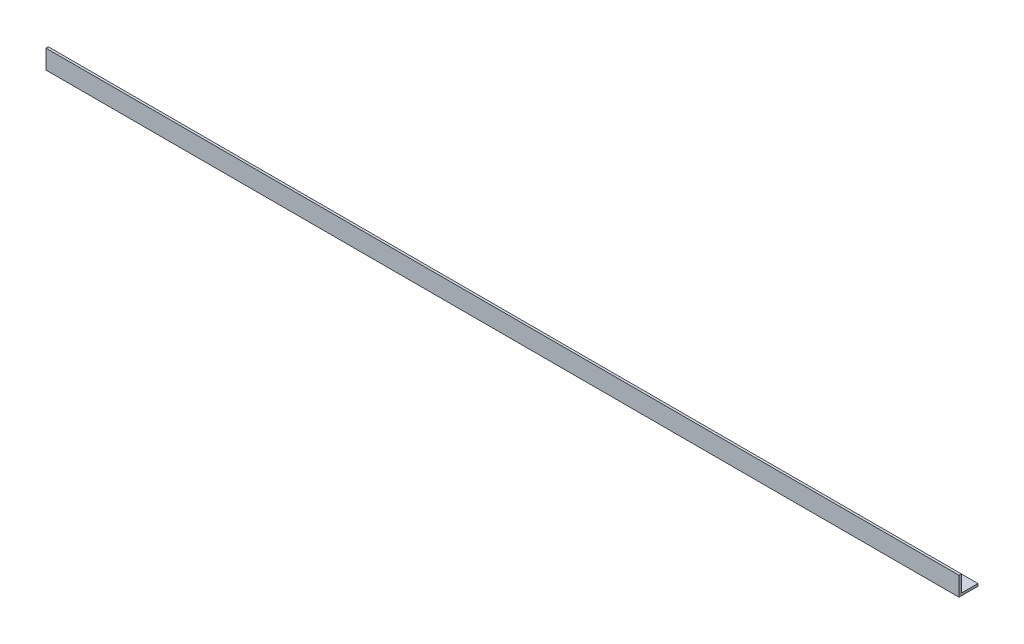
ISO-10303-21;
HEADER;
FILE_DESCRIPTION(('STEP AP214'),'2;1');
FILE_NAME('part.step','',(''),(''),'','','');
FILE_SCHEMA(('AUTOMOTIVE_DESIGN { 1 0 10303 214 1 1 1 1 }'));
ENDSEC;
DATA;
#1=APPLICATION_CONTEXT('core data for automotive mechanical design processes');
#2=APPLICATION_PROTOCOL_DEFINITION('international standard','automotive_design',2000,#1);
#3=PRODUCT_CONTEXT('',#1,'mechanical');
#4=PRODUCT('Part','Part','',(#3));
#5=PRODUCT_RELATED_PRODUCT_CATEGORY('part','',(#4));
#6=PRODUCT_DEFINITION_FORMATION('','',#4);
#7=PRODUCT_DEFINITION_CONTEXT('part definition',#1,'design');
#8=PRODUCT_DEFINITION('design','',#6,#7);
#9=PRODUCT_DEFINITION_SHAPE('','',#8);
#10=(LENGTH_UNIT() NAMED_UNIT(*) SI_UNIT(.MILLI.,.METRE.));
#11=(NAMED_UNIT(*) PLANE_ANGLE_UNIT() SI_UNIT($,.RADIAN.));
#12=(NAMED_UNIT(*) SI_UNIT($,.STERADIAN.) SOLID_ANGLE_UNIT());
#13=UNCERTAINTY_MEASURE_WITH_UNIT(LENGTH_MEASURE(1.E-05),#10,'distance_accuracy_value','');
#14=(GEOMETRIC_REPRESENTATION_CONTEXT(3) GLOBAL_UNCERTAINTY_ASSIGNED_CONTEXT((#13)) GLOBAL_UNIT_ASSIGNED_CONTEXT((#10,
#11,#12)) REPRESENTATION_CONTEXT('',''));
#15=CARTESIAN_POINT('',(0.,0.,0.));
#16=DIRECTION('',(0.,0.,1.));
#17=DIRECTION('',(1.,0.,0.));
#18=AXIS2_PLACEMENT_3D('',#15,#16,#17);
#19=CARTESIAN_POINT('',(609.6,0.,-25.4));
#20=DIRECTION('',(0.,1.,0.));
#21=DIRECTION('',(0.,0.,1.));
#22=AXIS2_PLACEMENT_3D('',#19,#20,#21);
#23=PLANE('',#22);
#24=DIRECTION('',(0.,0.,-1.));
#25=VECTOR('',#24,1.);
#26=CARTESIAN_POINT('',(-609.6,0.,-25.4));
#27=LINE('',#26,#25);
#28=CARTESIAN_POINT('',(-609.6,0.,0.));
#29=VERTEX_POINT('',#28);
#30=CARTESIAN_POINT('',(-609.6,0.,-25.4));
#31=VERTEX_POINT('',#30);
#32=EDGE_CURVE('E134',#29,#31,#27,.T.);
#33=ORIENTED_EDGE('',*,*,#32,.T.);
#34=DIRECTION('',(-1.,0.,0.));
#35=VECTOR('',#34,1.);
#36=CARTESIAN_POINT('',(609.6,0.,-25.4));
#37=LINE('',#36,#35);
#38=CARTESIAN_POINT('',(609.6,0.,-25.4));
#39=VERTEX_POINT('',#38);
#40=EDGE_CURVE('E11',#39,#31,#37,.T.);
#41=ORIENTED_EDGE('',*,*,#40,.F.);
#42=DIRECTION('',(0.,0.,-1.));
#43=VECTOR('',#42,1.);
#44=CARTESIAN_POINT('',(609.6,0.,-25.4));
#45=LINE('',#44,#43);
#46=CARTESIAN_POINT('',(609.6,0.,0.));
#47=VERTEX_POINT('',#46);
#48=EDGE_CURVE('E150',#47,#39,#45,.T.);
#49=ORIENTED_EDGE('',*,*,#48,.F.);
#50=DIRECTION('',(-1.,0.,0.));
#51=VECTOR('',#50,1.);
#52=CARTESIAN_POINT('',(609.6,0.,0.));
#53=LINE('',#52,#51);
#54=EDGE_CURVE('E130',#47,#29,#53,.T.);
#55=ORIENTED_EDGE('',*,*,#54,.T.);
#56=EDGE_LOOP('',(#33,#41,#49,#55));
#57=FACE_BOUND('',#56,.T.);
#58=ADVANCED_FACE('F45',(#57),#23,.F.);
#59=CARTESIAN_POINT('',(609.6,3.175,-25.4));
#60=DIRECTION('',(0.,0.,1.));
#61=DIRECTION('',(1.,0.,0.));
#62=AXIS2_PLACEMENT_3D('',#59,#60,#61);
#63=PLANE('',#62);
#64=DIRECTION('',(0.,1.,0.));
#65=VECTOR('',#64,1.);
#66=CARTESIAN_POINT('',(-609.6,3.175,-25.4));
#67=LINE('',#66,#65);
#68=CARTESIAN_POINT('',(-609.6,3.175,-25.4));
#69=VERTEX_POINT('',#68);
#70=EDGE_CURVE('E138',#31,#69,#67,.T.);
#71=ORIENTED_EDGE('',*,*,#70,.T.);
#72=DIRECTION('',(-1.,0.,0.));
#73=VECTOR('',#72,1.);
#74=CARTESIAN_POINT('',(609.6,3.175,-25.4));
#75=LINE('',#74,#73);
#76=CARTESIAN_POINT('',(609.6,3.175,-25.4));
#77=VERTEX_POINT('',#76);
#78=EDGE_CURVE('E54',#77,#69,#75,.T.);
#79=ORIENTED_EDGE('',*,*,#78,.F.);
#80=DIRECTION('',(0.,1.,0.));
#81=VECTOR('',#80,1.);
#82=CARTESIAN_POINT('',(609.6,3.175,-25.4));
#83=LINE('',#82,#81);
#84=EDGE_CURVE('E99',#39,#77,#83,.T.);
#85=ORIENTED_EDGE('',*,*,#84,.F.);
#86=ORIENTED_EDGE('',*,*,#40,.T.);
#87=EDGE_LOOP('',(#71,#79,#85,#86));
#88=FACE_BOUND('',#87,.T.);
#89=ADVANCED_FACE('F178',(#88),#63,.F.);
#90=CARTESIAN_POINT('',(609.6,3.175,-3.175));
#91=DIRECTION('',(0.,-1.,0.));
#92=DIRECTION('',(0.,0.,-1.));
#93=AXIS2_PLACEMENT_3D('',#90,#91,#92);
#94=PLANE('',#93);
#95=DIRECTION('',(0.,0.,1.));
#96=VECTOR('',#95,1.);
#97=CARTESIAN_POINT('',(-609.6,3.175,-3.175));
#98=LINE('',#97,#96);
#99=CARTESIAN_POINT('',(-609.6,3.175,-3.175));
#100=VERTEX_POINT('',#99);
#101=EDGE_CURVE('E141',#69,#100,#98,.T.);
#102=ORIENTED_EDGE('',*,*,#101,.T.);
#103=DIRECTION('',(-1.,0.,0.));
#104=VECTOR('',#103,1.);
#105=CARTESIAN_POINT('',(609.6,3.175,-3.175));
#106=LINE('',#105,#104);
#107=CARTESIAN_POINT('',(609.6,3.175,-3.175));
#108=VERTEX_POINT('',#107);
#109=EDGE_CURVE('E123',#108,#100,#106,.T.);
#110=ORIENTED_EDGE('',*,*,#109,.F.);
#111=DIRECTION('',(0.,0.,1.));
#112=VECTOR('',#111,1.);
#113=CARTESIAN_POINT('',(609.6,3.175,-3.175));
#114=LINE('',#113,#112);
#115=EDGE_CURVE('E112',#77,#108,#114,.T.);
#116=ORIENTED_EDGE('',*,*,#115,.F.);
#117=ORIENTED_EDGE('',*,*,#78,.T.);
#118=EDGE_LOOP('',(#102,#110,#116,#117));
#119=FACE_BOUND('',#118,.T.);
#120=ADVANCED_FACE('F160',(#119),#94,.F.);
#121=CARTESIAN_POINT('',(609.6,25.4,-3.175));
#122=DIRECTION('',(0.,0.,1.));
#123=DIRECTION('',(0.,-1.,0.));
#124=AXIS2_PLACEMENT_3D('',#121,#122,#123);
#125=PLANE('',#124);
#126=DIRECTION('',(0.,1.,0.));
#127=VECTOR('',#126,1.);
#128=CARTESIAN_POINT('',(-609.6,25.4,-3.175));
#129=LINE('',#128,#127);
#130=CARTESIAN_POINT('',(-609.6,25.4,-3.175));
#131=VERTEX_POINT('',#130);
#132=EDGE_CURVE('E121',#100,#131,#129,.T.);
#133=ORIENTED_EDGE('',*,*,#132,.T.);
#134=DIRECTION('',(-1.,0.,0.));
#135=VECTOR('',#134,1.);
#136=CARTESIAN_POINT('',(609.6,25.4,-3.175));
#137=LINE('',#136,#135);
#138=CARTESIAN_POINT('',(609.6,25.4,-3.175));
#139=VERTEX_POINT('',#138);
#140=EDGE_CURVE('E118',#139,#131,#137,.T.);
#141=ORIENTED_EDGE('',*,*,#140,.F.);
#142=DIRECTION('',(0.,1.,0.));
#143=VECTOR('',#142,1.);
#144=CARTESIAN_POINT('',(609.6,25.4,-3.175));
#145=LINE('',#144,#143);
#146=EDGE_CURVE('E106',#108,#139,#145,.T.);
#147=ORIENTED_EDGE('',*,*,#146,.F.);
#148=ORIENTED_EDGE('',*,*,#109,.T.);
#149=EDGE_LOOP('',(#133,#141,#147,#148));
#150=FACE_BOUND('',#149,.T.);
#151=ADVANCED_FACE('F119',(#150),#125,.F.);
#152=CARTESIAN_POINT('',(609.6,25.4,0.));
#153=DIRECTION('',(0.,-1.,0.));
#154=DIRECTION('',(0.,0.,-1.));
#155=AXIS2_PLACEMENT_3D('',#152,#153,#154);
#156=PLANE('',#155);
#157=DIRECTION('',(0.,0.,1.));
#158=VECTOR('',#157,1.);
#159=CARTESIAN_POINT('',(-609.6,25.4,0.));
#160=LINE('',#159,#158);
#161=CARTESIAN_POINT('',(-609.6,25.4,0.));
#162=VERTEX_POINT('',#161);
#163=EDGE_CURVE('E85',#131,#162,#160,.T.);
#164=ORIENTED_EDGE('',*,*,#163,.T.);
#165=DIRECTION('',(-1.,0.,0.));
#166=VECTOR('',#165,1.);
#167=CARTESIAN_POINT('',(609.6,25.4,0.));
#168=LINE('',#167,#166);
#169=CARTESIAN_POINT('',(609.6,25.4,0.));
#170=VERTEX_POINT('',#169);
#171=EDGE_CURVE('E124',#170,#162,#168,.T.);
#172=ORIENTED_EDGE('',*,*,#171,.F.);
#173=DIRECTION('',(0.,0.,1.));
#174=VECTOR('',#173,1.);
#175=CARTESIAN_POINT('',(609.6,25.4,0.));
#176=LINE('',#175,#174);
#177=EDGE_CURVE('E110',#139,#170,#176,.T.);
#178=ORIENTED_EDGE('',*,*,#177,.F.);
#179=ORIENTED_EDGE('',*,*,#140,.T.);
#180=EDGE_LOOP('',(#164,#172,#178,#179));
#181=FACE_BOUND('',#180,.T.);
#182=ADVANCED_FACE('F126',(#181),#156,.F.);
#183=CARTESIAN_POINT('',(609.6,0.,0.));
#184=DIRECTION('',(0.,0.,-1.));
#185=DIRECTION('',(-1.,0.,0.));
#186=AXIS2_PLACEMENT_3D('',#183,#184,#185);
#187=PLANE('',#186);
#188=DIRECTION('',(0.,-1.,0.));
#189=VECTOR('',#188,1.);
#190=CARTESIAN_POINT('',(-609.6,0.,0.));
#191=LINE('',#190,#189);
#192=EDGE_CURVE('E91',#162,#29,#191,.T.);
#193=ORIENTED_EDGE('',*,*,#192,.T.);
#194=ORIENTED_EDGE('',*,*,#54,.F.);
#195=DIRECTION('',(0.,-1.,0.));
#196=VECTOR('',#195,1.);
#197=CARTESIAN_POINT('',(609.6,0.,0.));
#198=LINE('',#197,#196);
#199=EDGE_CURVE('E62',#170,#47,#198,.T.);
#200=ORIENTED_EDGE('',*,*,#199,.F.);
#201=ORIENTED_EDGE('',*,*,#171,.T.);
#202=EDGE_LOOP('',(#193,#194,#200,#201));
#203=FACE_BOUND('',#202,.T.);
#204=ADVANCED_FACE('F167',(#203),#187,.F.);
#205=CARTESIAN_POINT('',(609.6,0.,0.));
#206=DIRECTION('',(-1.,0.,0.));
#207=DIRECTION('',(0.,0.,1.));
#208=AXIS2_PLACEMENT_3D('',#205,#206,#207);
#209=PLANE('',#208);
#210=ORIENTED_EDGE('',*,*,#48,.T.);
#211=ORIENTED_EDGE('',*,*,#84,.T.);
#212=ORIENTED_EDGE('',*,*,#115,.T.);
#213=ORIENTED_EDGE('',*,*,#146,.T.);
#214=ORIENTED_EDGE('',*,*,#177,.T.);
#215=ORIENTED_EDGE('',*,*,#199,.T.);
#216=EDGE_LOOP('',(#210,#211,#212,#213,#214,#215));
#217=FACE_BOUND('',#216,.T.);
#218=ADVANCED_FACE('F108',(#217),#209,.F.);
#219=CARTESIAN_POINT('',(-609.6,0.,0.));
#220=DIRECTION('',(-1.,0.,0.));
#221=DIRECTION('',(0.,0.,1.));
#222=AXIS2_PLACEMENT_3D('',#219,#220,#221);
#223=PLANE('',#222);
#224=ORIENTED_EDGE('',*,*,#32,.F.);
#225=ORIENTED_EDGE('',*,*,#192,.F.);
#226=ORIENTED_EDGE('',*,*,#163,.F.);
#227=ORIENTED_EDGE('',*,*,#132,.F.);
#228=ORIENTED_EDGE('',*,*,#101,.F.);
#229=ORIENTED_EDGE('',*,*,#70,.F.);
#230=EDGE_LOOP('',(#224,#225,#226,#227,#228,#229));
#231=FACE_BOUND('',#230,.T.);
#232=ADVANCED_FACE('F163',(#231),#223,.T.);
#233=CLOSED_SHELL('',(#58,#89,#120,#151,#182,#204,#218,#232));
#234=MANIFOLD_SOLID_BREP('B2',#233);
#235=ADVANCED_BREP_SHAPE_REPRESENTATION('',(#18,#234),#14);
#236=SHAPE_DEFINITION_REPRESENTATION(#9,#235);
ENDSEC;
END-ISO-10303-21;
